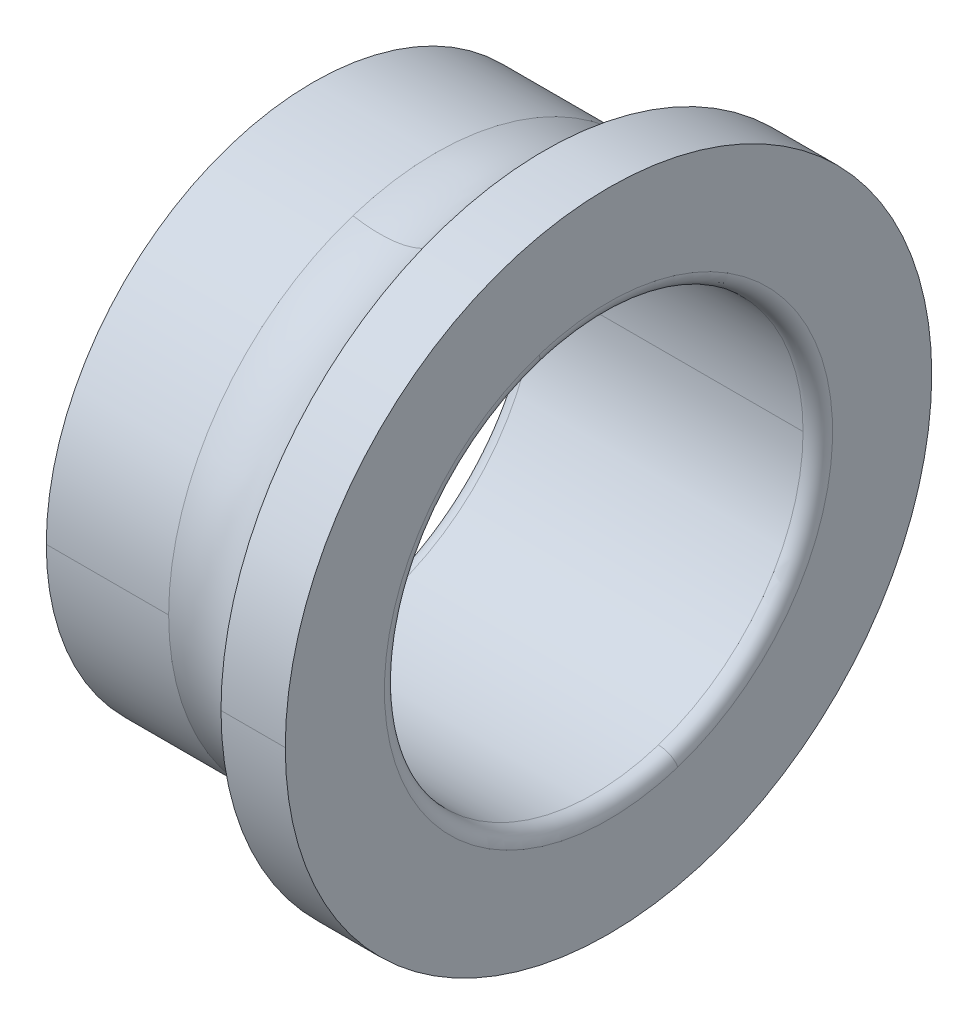
ISO-10303-21;
HEADER;
FILE_DESCRIPTION(('STEP AP214'),'2;1');
FILE_NAME('part.step','',(''),(''),'','','');
FILE_SCHEMA(('AUTOMOTIVE_DESIGN { 1 0 10303 214 1 1 1 1 }'));
ENDSEC;
DATA;
#1=APPLICATION_CONTEXT('core data for automotive mechanical design processes');
#2=APPLICATION_PROTOCOL_DEFINITION('international standard','automotive_design',2000,#1);
#3=PRODUCT_CONTEXT('',#1,'mechanical');
#4=PRODUCT('Part','Part','',(#3));
#5=PRODUCT_RELATED_PRODUCT_CATEGORY('part','',(#4));
#6=PRODUCT_DEFINITION_FORMATION('','',#4);
#7=PRODUCT_DEFINITION_CONTEXT('part definition',#1,'design');
#8=PRODUCT_DEFINITION('design','',#6,#7);
#9=PRODUCT_DEFINITION_SHAPE('','',#8);
#10=(LENGTH_UNIT() NAMED_UNIT(*) SI_UNIT(.MILLI.,.METRE.));
#11=(NAMED_UNIT(*) PLANE_ANGLE_UNIT() SI_UNIT($,.RADIAN.));
#12=(NAMED_UNIT(*) SI_UNIT($,.STERADIAN.) SOLID_ANGLE_UNIT());
#13=UNCERTAINTY_MEASURE_WITH_UNIT(LENGTH_MEASURE(1.E-05),#10,'distance_accuracy_value','');
#14=(GEOMETRIC_REPRESENTATION_CONTEXT(3) GLOBAL_UNCERTAINTY_ASSIGNED_CONTEXT((#13)) GLOBAL_UNIT_ASSIGNED_CONTEXT((#10,
#11,#12)) REPRESENTATION_CONTEXT('',''));
#15=CARTESIAN_POINT('',(0.,0.,0.));
#16=DIRECTION('',(0.,0.,1.));
#17=DIRECTION('',(1.,0.,0.));
#18=AXIS2_PLACEMENT_3D('',#15,#16,#17);
#19=CARTESIAN_POINT('',(12.,0.,0.));
#20=DIRECTION('',(1.,0.,0.));
#21=DIRECTION('',(0.,1.,0.));
#22=AXIS2_PLACEMENT_3D('',#19,#20,#21);
#23=CYLINDRICAL_SURFACE('',#22,10.83);
#24=DIRECTION('',(1.,0.,0.));
#25=VECTOR('',#24,1.);
#26=CARTESIAN_POINT('',(0.,0.,10.83));
#27=LINE('',#26,#25);
#28=CARTESIAN_POINT('',(0.,0.,10.83));
#29=VERTEX_POINT('',#28);
#30=CARTESIAN_POINT('',(4.969085842565,0.,10.83));
#31=VERTEX_POINT('',#30);
#32=EDGE_CURVE('E11',#29,#31,#27,.T.);
#33=ORIENTED_EDGE('',*,*,#32,.F.);
#34=CARTESIAN_POINT('',(0.,0.,0.));
#35=DIRECTION('',(1.,0.,0.));
#36=DIRECTION('',(0.,0.,-1.));
#37=AXIS2_PLACEMENT_3D('',#34,#35,#36);
#38=CIRCLE('',#37,10.83);
#39=CARTESIAN_POINT('',(0.,0.,-10.83));
#40=VERTEX_POINT('',#39);
#41=EDGE_CURVE('E24',#29,#40,#38,.T.);
#42=ORIENTED_EDGE('',*,*,#41,.T.);
#43=DIRECTION('',(1.,0.,0.));
#44=VECTOR('',#43,1.);
#45=CARTESIAN_POINT('',(0.,0.,-10.83));
#46=LINE('',#45,#44);
#47=CARTESIAN_POINT('',(4.969085842565,0.,-10.83));
#48=VERTEX_POINT('',#47);
#49=EDGE_CURVE('E325',#40,#48,#46,.T.);
#50=ORIENTED_EDGE('',*,*,#49,.T.);
#51=CARTESIAN_POINT('',(4.969085842565,0.,0.));
#52=DIRECTION('',(1.,0.,0.));
#53=DIRECTION('',(0.,0.,-1.));
#54=AXIS2_PLACEMENT_3D('',#51,#52,#53);
#55=CIRCLE('',#54,10.83);
#56=CARTESIAN_POINT('',(4.96908584256501,-10.2999420714765,-3.34665404908068));
#57=VERTEX_POINT('',#56);
#58=EDGE_CURVE('E320',#57,#48,#55,.T.);
#59=ORIENTED_EDGE('',*,*,#58,.F.);
#60=CARTESIAN_POINT('',(4.969085842565,0.,0.));
#61=DIRECTION('',(1.,0.,0.));
#62=DIRECTION('',(0.,0.,-1.));
#63=AXIS2_PLACEMENT_3D('',#60,#61,#62);
#64=CIRCLE('',#63,10.83);
#65=EDGE_CURVE('E315',#31,#57,#64,.T.);
#66=ORIENTED_EDGE('',*,*,#65,.F.);
#67=EDGE_LOOP('',(#33,#42,#50,#59,#66));
#68=FACE_BOUND('',#67,.T.);
#69=ADVANCED_FACE('F16',(#68),#23,.T.);
#70=CARTESIAN_POINT('',(5.99999999999977,0.,0.));
#71=DIRECTION('',(1.,0.,0.));
#72=DIRECTION('',(0.,0.309016994374947,-0.951056516295154));
#73=AXIS2_PLACEMENT_3D('',#70,#71,#72);
#74=TOROIDAL_SURFACE('',#73,14.2500000000004,3.57200000000031);
#75=CARTESIAN_POINT('',(5.99999999999977,-13.5525553572063,-4.40349216984313));
#76=DIRECTION('',(0.,0.309016994374947,-0.951056516295154));
#77=DIRECTION('',(-0.288609786515865,0.910586026240071,0.295867335039853));
#78=AXIS2_PLACEMENT_3D('',#75,#76,#77);
#79=CIRCLE('',#78,3.57200000000031);
#80=CARTESIAN_POINT('',(9.3902151849108,-12.4826167763739,-4.05584805117118));
#81=VERTEX_POINT('',#80);
#82=EDGE_CURVE('E311',#57,#81,#79,.T.);
#83=ORIENTED_EDGE('',*,*,#82,.T.);
#84=CARTESIAN_POINT('',(9.3902151849108,0.,0.));
#85=DIRECTION('',(1.,0.,0.));
#86=DIRECTION('',(0.,0.,-1.));
#87=AXIS2_PLACEMENT_3D('',#84,#85,#86);
#88=CIRCLE('',#87,13.125);
#89=CARTESIAN_POINT('',(9.3902151849108,0.,13.125));
#90=VERTEX_POINT('',#89);
#91=EDGE_CURVE('E109',#90,#81,#88,.T.);
#92=ORIENTED_EDGE('',*,*,#91,.F.);
#93=CARTESIAN_POINT('',(9.3902151849108,0.,0.));
#94=DIRECTION('',(1.,0.,0.));
#95=DIRECTION('',(0.,0.,-1.));
#96=AXIS2_PLACEMENT_3D('',#93,#94,#95);
#97=CIRCLE('',#96,13.125);
#98=CARTESIAN_POINT('',(9.3902151849108,12.4826167763739,4.05584805117119));
#99=VERTEX_POINT('',#98);
#100=EDGE_CURVE('E304',#99,#90,#97,.T.);
#101=ORIENTED_EDGE('',*,*,#100,.F.);
#102=CARTESIAN_POINT('',(5.99999999999977,13.5525553572063,4.40349216984313));
#103=DIRECTION('',(0.,-0.309016994374947,0.951056516295154));
#104=DIRECTION('',(-0.288609786515866,-0.91058602624007,-0.295867335039853));
#105=AXIS2_PLACEMENT_3D('',#102,#103,#104);
#106=CIRCLE('',#105,3.57200000000031);
#107=CARTESIAN_POINT('',(4.96908584256501,10.2999420714765,3.34665404908068));
#108=VERTEX_POINT('',#107);
#109=EDGE_CURVE('E119',#108,#99,#106,.T.);
#110=ORIENTED_EDGE('',*,*,#109,.F.);
#111=CARTESIAN_POINT('',(4.969085842565,0.,0.));
#112=DIRECTION('',(1.,0.,0.));
#113=DIRECTION('',(0.,0.,-1.));
#114=AXIS2_PLACEMENT_3D('',#111,#112,#113);
#115=CIRCLE('',#114,10.83);
#116=EDGE_CURVE('E296',#108,#31,#115,.T.);
#117=ORIENTED_EDGE('',*,*,#116,.T.);
#118=ORIENTED_EDGE('',*,*,#65,.T.);
#119=EDGE_LOOP('',(#83,#92,#101,#110,#117,#118));
#120=FACE_BOUND('',#119,.T.);
#121=ADVANCED_FACE('F338',(#120),#74,.F.);
#122=CARTESIAN_POINT('',(12.,0.,0.));
#123=DIRECTION('',(1.,0.,0.));
#124=DIRECTION('',(0.,-1.,0.));
#125=AXIS2_PLACEMENT_3D('',#122,#123,#124);
#126=CYLINDRICAL_SURFACE('',#125,10.83);
#127=ORIENTED_EDGE('',*,*,#32,.T.);
#128=ORIENTED_EDGE('',*,*,#116,.F.);
#129=CARTESIAN_POINT('',(4.969085842565,0.,0.));
#130=DIRECTION('',(1.,0.,0.));
#131=DIRECTION('',(0.,0.,-1.));
#132=AXIS2_PLACEMENT_3D('',#129,#130,#131);
#133=CIRCLE('',#132,10.83);
#134=EDGE_CURVE('E292',#48,#108,#133,.T.);
#135=ORIENTED_EDGE('',*,*,#134,.F.);
#136=ORIENTED_EDGE('',*,*,#49,.F.);
#137=CARTESIAN_POINT('',(0.,0.,0.));
#138=DIRECTION('',(1.,0.,0.));
#139=DIRECTION('',(0.,0.,-1.));
#140=AXIS2_PLACEMENT_3D('',#137,#138,#139);
#141=CIRCLE('',#140,10.83);
#142=EDGE_CURVE('E288',#40,#29,#141,.T.);
#143=ORIENTED_EDGE('',*,*,#142,.T.);
#144=EDGE_LOOP('',(#127,#128,#135,#136,#143));
#145=FACE_BOUND('',#144,.T.);
#146=ADVANCED_FACE('F269',(#145),#126,.T.);
#147=CARTESIAN_POINT('',(0.,10.83,0.));
#148=DIRECTION('',(-1.,0.,0.));
#149=DIRECTION('',(0.,0.,1.));
#150=AXIS2_PLACEMENT_3D('',#147,#148,#149);
#151=PLANE('',#150);
#152=CARTESIAN_POINT('',(0.,0.,0.));
#153=DIRECTION('',(1.,0.,0.));
#154=DIRECTION('',(0.,0.,-1.));
#155=AXIS2_PLACEMENT_3D('',#152,#153,#154);
#156=CIRCLE('',#155,9.1);
#157=CARTESIAN_POINT('',(0.,8.6546142982859,2.81205464881202));
#158=VERTEX_POINT('',#157);
#159=CARTESIAN_POINT('',(0.,-8.6546142982859,-2.81205464881202));
#160=VERTEX_POINT('',#159);
#161=EDGE_CURVE('E286',#158,#160,#156,.T.);
#162=ORIENTED_EDGE('',*,*,#161,.T.);
#163=CARTESIAN_POINT('',(0.,-8.6546142982859,-2.81205464881202));
#164=CARTESIAN_POINT('',(0.,-7.77035322156963,-5.52977285694612));
#165=CARTESIAN_POINT('',(0.,-5.82361355448477,-7.90801404603314));
#166=CARTESIAN_POINT('',(0.,-2.97302640379702,-9.35676213057699));
#167=CARTESIAN_POINT('',(0.,3.15812466204302,-9.71970828071693));
#168=CARTESIAN_POINT('',(0.,7.90499567495906,-5.82227850113272));
#169=CARTESIAN_POINT('',(0.,9.35961636543055,-2.97468359261989));
#170=CARTESIAN_POINT('',(0.,9.53666674238609,0.0936188124392139));
#171=CARTESIAN_POINT('',(0.,8.6546142982859,2.81205464881202));
#172=B_SPLINE_CURVE_WITH_KNOTS('',5,(#163,#164,#165,#166,#167,#168,#169,#170,#171),
.UNSPECIFIED.,.F.,.F.,(6,3,6),(0.,1.5707963267949,3.14159265358979),.UNSPECIFIED.);
#173=EDGE_CURVE('E284',#160,#158,#172,.T.);
#174=ORIENTED_EDGE('',*,*,#173,.T.);
#175=EDGE_LOOP('',(#162,#174));
#176=FACE_BOUND('',#175,.T.);
#177=ORIENTED_EDGE('',*,*,#41,.F.);
#178=ORIENTED_EDGE('',*,*,#142,.F.);
#179=EDGE_LOOP('',(#177,#178));
#180=FACE_BOUND('',#179,.T.);
#181=ADVANCED_FACE('F263',(#176,#180),#151,.T.);
#182=CARTESIAN_POINT('',(0.600000000000048,0.,0.));
#183=DIRECTION('',(1.,0.,0.));
#184=DIRECTION('',(0.,-0.309016994374947,0.951056516295154));
#185=AXIS2_PLACEMENT_3D('',#182,#183,#184);
#186=TOROIDAL_SURFACE('',#185,9.1,0.600000000000048);
#187=CARTESIAN_POINT('',(0.600000000000048,-8.6546142982859,-2.81205464881202));
#188=DIRECTION('',(0.,0.309016994374947,-0.951056516295154));
#189=DIRECTION('',(-1.,0.,0.));
#190=AXIS2_PLACEMENT_3D('',#187,#188,#189);
#191=CIRCLE('',#190,0.600000000000048);
#192=CARTESIAN_POINT('',(0.600000000000001,-8.08398038850876,-2.62664445218704));
#193=VERTEX_POINT('',#192);
#194=EDGE_CURVE('E494',#160,#193,#191,.T.);
#195=ORIENTED_EDGE('',*,*,#194,.T.);
#196=CARTESIAN_POINT('',(0.6,0.,0.));
#197=DIRECTION('',(1.,0.,0.));
#198=DIRECTION('',(0.,0.,-1.));
#199=AXIS2_PLACEMENT_3D('',#196,#197,#198);
#200=CIRCLE('',#199,8.5);
#201=CARTESIAN_POINT('',(0.6,0.,-8.5));
#202=VERTEX_POINT('',#201);
#203=EDGE_CURVE('E492',#193,#202,#200,.T.);
#204=ORIENTED_EDGE('',*,*,#203,.T.);
#205=CARTESIAN_POINT('',(0.6,0.,0.));
#206=DIRECTION('',(1.,0.,0.));
#207=DIRECTION('',(0.,0.,-1.));
#208=AXIS2_PLACEMENT_3D('',#205,#206,#207);
#209=CIRCLE('',#208,8.5);
#210=CARTESIAN_POINT('',(0.6,8.08398038850876,2.62664445218704));
#211=VERTEX_POINT('',#210);
#212=EDGE_CURVE('E490',#202,#211,#209,.T.);
#213=ORIENTED_EDGE('',*,*,#212,.T.);
#214=CARTESIAN_POINT('',(0.600000000000048,8.6546142982859,2.81205464881202));
#215=DIRECTION('',(0.,-0.309016994374947,0.951056516295154));
#216=DIRECTION('',(-1.,0.,0.));
#217=AXIS2_PLACEMENT_3D('',#214,#215,#216);
#218=CIRCLE('',#217,0.600000000000048);
#219=EDGE_CURVE('E243',#158,#211,#218,.T.);
#220=ORIENTED_EDGE('',*,*,#219,.F.);
#221=ORIENTED_EDGE('',*,*,#173,.F.);
#222=EDGE_LOOP('',(#195,#204,#213,#220,#221));
#223=FACE_BOUND('',#222,.T.);
#224=ADVANCED_FACE('F252',(#223),#186,.T.);
#225=CARTESIAN_POINT('',(0.600000000000048,0.,0.));
#226=DIRECTION('',(1.,0.,0.));
#227=DIRECTION('',(0.,0.309016994374947,-0.951056516295154));
#228=AXIS2_PLACEMENT_3D('',#225,#226,#227);
#229=TOROIDAL_SURFACE('',#228,9.1,0.600000000000048);
#230=ORIENTED_EDGE('',*,*,#194,.F.);
#231=ORIENTED_EDGE('',*,*,#161,.F.);
#232=ORIENTED_EDGE('',*,*,#219,.T.);
#233=CARTESIAN_POINT('',(0.6,0.,0.));
#234=DIRECTION('',(1.,0.,0.));
#235=DIRECTION('',(0.,0.,-1.));
#236=AXIS2_PLACEMENT_3D('',#233,#234,#235);
#237=CIRCLE('',#236,8.5);
#238=CARTESIAN_POINT('',(0.6,0.,8.5));
#239=VERTEX_POINT('',#238);
#240=EDGE_CURVE('E239',#211,#239,#237,.T.);
#241=ORIENTED_EDGE('',*,*,#240,.T.);
#242=CARTESIAN_POINT('',(0.6,0.,0.));
#243=DIRECTION('',(1.,0.,0.));
#244=DIRECTION('',(0.,0.,-1.));
#245=AXIS2_PLACEMENT_3D('',#242,#243,#244);
#246=CIRCLE('',#245,8.5);
#247=EDGE_CURVE('E234',#239,#193,#246,.T.);
#248=ORIENTED_EDGE('',*,*,#247,.T.);
#249=EDGE_LOOP('',(#230,#231,#232,#241,#248));
#250=FACE_BOUND('',#249,.T.);
#251=ADVANCED_FACE('F262',(#250),#229,.T.);
#252=CARTESIAN_POINT('',(12.,0.,0.));
#253=DIRECTION('',(1.,0.,0.));
#254=DIRECTION('',(0.,1.,0.));
#255=AXIS2_PLACEMENT_3D('',#252,#253,#254);
#256=CYLINDRICAL_SURFACE('',#255,8.5);
#257=DIRECTION('',(1.,0.,0.));
#258=VECTOR('',#257,1.);
#259=CARTESIAN_POINT('',(0.6,0.,8.5));
#260=LINE('',#259,#258);
#261=CARTESIAN_POINT('',(11.4,0.,8.5));
#262=VERTEX_POINT('',#261);
#263=EDGE_CURVE('E230',#239,#262,#260,.T.);
#264=ORIENTED_EDGE('',*,*,#263,.T.);
#265=CARTESIAN_POINT('',(11.4,0.,0.));
#266=DIRECTION('',(1.,0.,0.));
#267=DIRECTION('',(0.,0.,-1.));
#268=AXIS2_PLACEMENT_3D('',#265,#266,#267);
#269=CIRCLE('',#268,8.5);
#270=CARTESIAN_POINT('',(11.4,-8.08398038850888,-2.62664445218707));
#271=VERTEX_POINT('',#270);
#272=EDGE_CURVE('E226',#262,#271,#269,.T.);
#273=ORIENTED_EDGE('',*,*,#272,.T.);
#274=CARTESIAN_POINT('',(11.4,0.,0.));
#275=DIRECTION('',(1.,0.,0.));
#276=DIRECTION('',(0.,0.,-1.));
#277=AXIS2_PLACEMENT_3D('',#274,#275,#276);
#278=CIRCLE('',#277,8.5);
#279=CARTESIAN_POINT('',(11.4,0.,-8.5));
#280=VERTEX_POINT('',#279);
#281=EDGE_CURVE('E222',#271,#280,#278,.T.);
#282=ORIENTED_EDGE('',*,*,#281,.T.);
#283=DIRECTION('',(1.,0.,0.));
#284=VECTOR('',#283,1.);
#285=CARTESIAN_POINT('',(0.6,0.,-8.5));
#286=LINE('',#285,#284);
#287=EDGE_CURVE('E217',#202,#280,#286,.T.);
#288=ORIENTED_EDGE('',*,*,#287,.F.);
#289=ORIENTED_EDGE('',*,*,#203,.F.);
#290=ORIENTED_EDGE('',*,*,#247,.F.);
#291=EDGE_LOOP('',(#264,#273,#282,#288,#289,#290));
#292=FACE_BOUND('',#291,.T.);
#293=ADVANCED_FACE('F390',(#292),#256,.F.);
#294=CARTESIAN_POINT('',(12.,0.,0.));
#295=DIRECTION('',(1.,0.,0.));
#296=DIRECTION('',(0.,-1.,0.));
#297=AXIS2_PLACEMENT_3D('',#294,#295,#296);
#298=CYLINDRICAL_SURFACE('',#297,8.5);
#299=ORIENTED_EDGE('',*,*,#263,.F.);
#300=ORIENTED_EDGE('',*,*,#240,.F.);
#301=ORIENTED_EDGE('',*,*,#212,.F.);
#302=ORIENTED_EDGE('',*,*,#287,.T.);
#303=CARTESIAN_POINT('',(11.4,0.,0.));
#304=DIRECTION('',(1.,0.,0.));
#305=DIRECTION('',(0.,0.,-1.));
#306=AXIS2_PLACEMENT_3D('',#303,#304,#305);
#307=CIRCLE('',#306,8.5);
#308=CARTESIAN_POINT('',(11.4,8.08398038850888,2.62664445218708));
#309=VERTEX_POINT('',#308);
#310=EDGE_CURVE('E213',#280,#309,#307,.T.);
#311=ORIENTED_EDGE('',*,*,#310,.T.);
#312=CARTESIAN_POINT('',(11.4,0.,0.));
#313=DIRECTION('',(1.,0.,0.));
#314=DIRECTION('',(0.,0.,-1.));
#315=AXIS2_PLACEMENT_3D('',#312,#313,#314);
#316=CIRCLE('',#315,8.5);
#317=EDGE_CURVE('E208',#309,#262,#316,.T.);
#318=ORIENTED_EDGE('',*,*,#317,.T.);
#319=EDGE_LOOP('',(#299,#300,#301,#302,#311,#318));
#320=FACE_BOUND('',#319,.T.);
#321=ADVANCED_FACE('F400',(#320),#298,.F.);
#322=CARTESIAN_POINT('',(11.4,0.,0.));
#323=DIRECTION('',(1.,0.,0.));
#324=DIRECTION('',(0.,0.309016994374947,-0.951056516295154));
#325=AXIS2_PLACEMENT_3D('',#322,#323,#324);
#326=TOROIDAL_SURFACE('',#325,9.1,0.599999999999927);
#327=CARTESIAN_POINT('',(11.4,-8.6546142982859,-2.81205464881202));
#328=DIRECTION('',(0.,0.309016994374947,-0.951056516295154));
#329=DIRECTION('',(0.,0.951056516295154,0.309016994374947));
#330=AXIS2_PLACEMENT_3D('',#327,#328,#329);
#331=CIRCLE('',#330,0.599999999999927);
#332=CARTESIAN_POINT('',(11.9999999999999,-8.6546142982859,-2.81205464881202));
#333=VERTEX_POINT('',#332);
#334=EDGE_CURVE('E187',#271,#333,#331,.T.);
#335=ORIENTED_EDGE('',*,*,#334,.F.);
#336=ORIENTED_EDGE('',*,*,#272,.F.);
#337=ORIENTED_EDGE('',*,*,#317,.F.);
#338=CARTESIAN_POINT('',(11.4,8.6546142982859,2.81205464881202));
#339=DIRECTION('',(0.,-0.309016994374947,0.951056516295154));
#340=DIRECTION('',(0.,-0.951056516295154,-0.309016994374947));
#341=AXIS2_PLACEMENT_3D('',#338,#339,#340);
#342=CIRCLE('',#341,0.599999999999927);
#343=CARTESIAN_POINT('',(11.9999999999999,8.6546142982859,2.81205464881202));
#344=VERTEX_POINT('',#343);
#345=EDGE_CURVE('E186',#309,#344,#342,.T.);
#346=ORIENTED_EDGE('',*,*,#345,.T.);
#347=CARTESIAN_POINT('',(11.9999999999999,8.65461429828589,2.81205464881204));
#348=CARTESIAN_POINT('',(11.9999999999999,8.60860511914574,2.95366656315673));
#349=CARTESIAN_POINT('',(11.9999999999999,8.55911447032686,3.09414699684201));
#350=CARTESIAN_POINT('',(11.9999999999999,8.45330243894805,3.37251140646159));
#351=CARTESIAN_POINT('',(11.9999999999999,8.39698105638814,3.51039538239588));
#352=CARTESIAN_POINT('',(11.9999999999999,8.27763976314372,3.78323338008131));
#353=CARTESIAN_POINT('',(11.9999999999999,8.21461985245923,3.91818740183245));
#354=CARTESIAN_POINT('',(11.9999999999999,8.08203425525104,4.1848407292831));
#355=CARTESIAN_POINT('',(11.9999999999999,8.01246856872733,4.3165400349826));
#356=CARTESIAN_POINT('',(11.9999999999999,7.86695875999756,4.576366560262));
#357=CARTESIAN_POINT('',(11.9999999999999,7.79101463779149,4.70449377984189));
#358=CARTESIAN_POINT('',(11.9999999999999,7.63293098063957,4.9568674886172));
#359=CARTESIAN_POINT('',(11.9999999999999,7.55079144569371,5.08111397781262));
#360=CARTESIAN_POINT('',(11.9999999999999,7.38051482647062,5.32542689832994));
#361=CARTESIAN_POINT('',(11.9999999999999,7.29237774219337,5.44549332965184));
#362=CARTESIAN_POINT('',(11.9999999999999,7.11031835906663,5.68115688569824));
#363=CARTESIAN_POINT('',(11.9999999999999,7.01639606021713,5.79675401042276));
#364=CARTESIAN_POINT('',(11.9999999999999,6.82299251370341,6.02320046918661));
#365=CARTESIAN_POINT('',(11.9999999999999,6.7235112660392,6.13404980322595));
#366=CARTESIAN_POINT('',(11.9999999999999,6.51922948128005,6.35073363499558));
#367=CARTESIAN_POINT('',(11.9999999999999,6.41442894418512,6.45656813272588));
#368=CARTESIAN_POINT('',(11.9999999999999,6.19976105414544,6.66296732726726));
#369=CARTESIAN_POINT('',(11.9999999999999,6.08989370120069,6.76353202407835));
#370=CARTESIAN_POINT('',(11.9999999999999,5.86535685956264,6.95914934762769));
#371=CARTESIAN_POINT('',(11.9999999999999,5.75068737086933,7.05420197436594));
#372=CARTESIAN_POINT('',(11.9999999999999,5.51682250656963,7.23856616766363));
#373=CARTESIAN_POINT('',(11.9999999999999,5.39762713096324,7.32787773422308));
#374=CARTESIAN_POINT('',(11.9999999999999,5.15499764493929,7.50054464777724));
#375=CARTESIAN_POINT('',(11.9999999999999,5.03156353452172,7.58389999477195));
#376=CARTESIAN_POINT('',(11.9999999999999,4.78075394245847,7.74445365886448));
#377=CARTESIAN_POINT('',(11.9999999999999,4.65337846081279,7.82165197596229));
#378=CARTESIAN_POINT('',(11.9999999999999,4.3949929849855,7.96970560275342));
#379=CARTESIAN_POINT('',(11.9999999999999,4.2639829908039,8.04056091244673));
#380=CARTESIAN_POINT('',(11.9999999999999,3.99864410445583,8.17575782778158));
#381=CARTESIAN_POINT('',(11.9999999999999,3.86431521228938,8.24009943342312));
#382=CARTESIAN_POINT('',(11.9999999999999,3.59266214003866,8.3621139360908));
#383=CARTESIAN_POINT('',(11.9999999999999,3.45533795995441,8.41978683311693));
#384=CARTESIAN_POINT('',(11.9999999999999,3.1780251378461,8.5283249794933));
#385=CARTESIAN_POINT('',(11.9999999999999,3.03803649582205,8.57919022884354));
#386=CARTESIAN_POINT('',(11.9999999999999,2.75573199473434,8.67399054102716));
#387=CARTESIAN_POINT('',(11.9999999999999,2.61341613567068,8.71792560386054));
#388=CARTESIAN_POINT('',(11.9999999999999,2.32680005187365,8.79875969959584));
#389=CARTESIAN_POINT('',(11.9999999999999,2.18249982714027,8.83565873249775));
#390=CARTESIAN_POINT('',(11.9999999999999,1.89226264388438,8.90233187536787));
#391=CARTESIAN_POINT('',(11.9999999999999,1.74632568536187,8.93210598533607));
#392=CARTESIAN_POINT('',(11.9999999999999,1.45316660944336,8.98445755389996));
#393=CARTESIAN_POINT('',(11.9999999999999,1.30594449204736,9.00703501249564));
#394=CARTESIAN_POINT('',(11.9999999999999,1.01056976935783,9.04493888723916));
#395=CARTESIAN_POINT('',(11.9999999999999,0.862417164064294,9.060265303387));
#396=CARTESIAN_POINT('',(11.9999999999999,0.565538378182463,9.08363017055592));
#397=CARTESIAN_POINT('',(11.9999999999999,0.41681219759417,9.091668621577));
#398=CARTESIAN_POINT('',(11.9999999999999,0.119144555518741,9.10043819315979));
#399=CARTESIAN_POINT('',(11.9999999999999,-0.0297969059683946,9.1011693137215));
#400=CARTESIAN_POINT('',(11.9999999999999,-0.327536296815056,9.09532246305208));
#401=CARTESIAN_POINT('',(11.9999999999999,-0.476334226174581,9.08874449182095));
#402=CARTESIAN_POINT('',(11.9999999999999,-0.773428085521034,9.06829530447473));
#403=CARTESIAN_POINT('',(11.9999999999999,-0.921724015507962,9.05442408835962));
#404=CARTESIAN_POINT('',(11.9999999999999,-1.21745661822469,9.01942182822004));
#405=CARTESIAN_POINT('',(11.9999999999999,-1.3648932909545,8.99829078419555));
#406=CARTESIAN_POINT('',(11.9999999999999,-1.65855219129844,8.94881977477311));
#407=CARTESIAN_POINT('',(11.9999999999999,-1.80477441891259,8.92047980937516));
#408=CARTESIAN_POINT('',(11.9999999999999,-2.09565216687134,8.85665923066472));
#409=CARTESIAN_POINT('',(11.9999999999999,-2.24030768721596,8.82117861735223));
#410=CARTESIAN_POINT('',(11.9999999999999,-2.5277035328168,8.74316221871793));
#411=CARTESIAN_POINT('',(11.9999999999999,-2.67044385807303,8.70062643339611));
#412=CARTESIAN_POINT('',(11.9999999999999,-2.95366543955102,8.60860216317568));
#413=CARTESIAN_POINT('',(11.9999999999999,-3.09414669577276,8.55911367827707));
#414=CARTESIAN_POINT('',(11.9999999999999,-3.37251170753082,8.45330323099785));
#415=CARTESIAN_POINT('',(11.9999999999999,-3.51039546306713,8.39698126861724));
#416=CARTESIAN_POINT('',(11.9999999999999,-3.78323329941004,8.27763955091463));
#417=CARTESIAN_POINT('',(11.9999999999999,-3.91818738021664,8.21461979559262));
#418=CARTESIAN_POINT('',(11.9999999999999,-4.18484075089888,8.08203431211766));
#419=CARTESIAN_POINT('',(11.9999999999999,-4.31654004077453,8.01246858396471));
#420=CARTESIAN_POINT('',(11.9999999999999,-4.57636655447005,7.8669587447602));
#421=CARTESIAN_POINT('',(11.9999999999999,-4.70449377828993,7.79101463370866));
#422=CARTESIAN_POINT('',(11.9999999999999,-4.95686749016913,7.63293098472241));
#423=CARTESIAN_POINT('',(11.9999999999999,-5.08111397822846,7.55079144678772));
#424=CARTESIAN_POINT('',(11.9999999999999,-5.32542689791409,7.38051482537663));
#425=CARTESIAN_POINT('',(11.9999999999999,-5.4454933295404,7.29237774190024));
#426=CARTESIAN_POINT('',(11.9999999999999,-5.68115688580966,7.11031835935977));
#427=CARTESIAN_POINT('',(11.9999999999999,-5.7967540104526,7.01639606029568));
#428=CARTESIAN_POINT('',(11.9999999999999,-6.02320046915674,6.82299251362488));
#429=CARTESIAN_POINT('',(11.9999999999999,-6.13404980321794,6.72351126601816));
#430=CARTESIAN_POINT('',(11.9999999999999,-6.35073363500357,6.5192294813011));
#431=CARTESIAN_POINT('',(11.9999999999999,-6.45656813272801,6.41442894419076));
#432=CARTESIAN_POINT('',(11.9999999999999,-6.66296732726511,6.19976105413981));
#433=CARTESIAN_POINT('',(11.9999999999999,-6.76353202407777,6.08989370119919));
#434=CARTESIAN_POINT('',(11.9999999999999,-6.95914934762826,5.86535685956416));
#435=CARTESIAN_POINT('',(11.9999999999999,-7.05420197436608,5.75068737086975));
#436=CARTESIAN_POINT('',(11.9999999999999,-7.23856616766347,5.51682250656924));
#437=CARTESIAN_POINT('',(11.9999999999999,-7.32787773422303,5.39762713096315));
#438=CARTESIAN_POINT('',(11.9999999999999,-7.50054464777727,5.15499764493941));
#439=CARTESIAN_POINT('',(11.9999999999999,-7.58389999477195,5.03156353452176));
#440=CARTESIAN_POINT('',(11.9999999999999,-7.74445365886446,4.78075394245845));
#441=CARTESIAN_POINT('',(11.9999999999999,-7.82165197596228,4.65337846081279));
#442=CARTESIAN_POINT('',(11.9999999999999,-7.96970560275342,4.39499298498552));
#443=CARTESIAN_POINT('',(11.9999999999999,-8.04056091244673,4.26398299080391));
#444=CARTESIAN_POINT('',(11.9999999999999,-8.17575782778157,3.99864410445584));
#445=CARTESIAN_POINT('',(11.9999999999999,-8.24009943342311,3.86431521228939));
#446=CARTESIAN_POINT('',(11.9999999999999,-8.3621139360908,3.59266214003867));
#447=CARTESIAN_POINT('',(11.9999999999999,-8.41978683311696,3.45533795995441));
#448=CARTESIAN_POINT('',(11.9999999999999,-8.52832497949327,3.17802513784612));
#449=CARTESIAN_POINT('',(11.9999999999999,-8.57919022884342,3.03803649582209));
#450=CARTESIAN_POINT('',(11.9999999999999,-8.67399054102727,2.75573199473432));
#451=CARTESIAN_POINT('',(11.9999999999999,-8.71792560386096,2.61341613567058));
#452=CARTESIAN_POINT('',(11.9999999999999,-8.79875969959542,2.32680005187377));
#453=CARTESIAN_POINT('',(11.9999999999999,-8.83565873249619,2.1824998271407));
#454=CARTESIAN_POINT('',(11.9999999999999,-8.90233187536943,1.89226264388397));
#455=CARTESIAN_POINT('',(11.9999999999999,-8.9321059853419,1.7463256853603));
#456=CARTESIAN_POINT('',(11.9999999999999,-8.98445755389413,1.45316660944496));
#457=CARTESIAN_POINT('',(11.9999999999999,-9.00703501247391,1.30594449205328));
#458=CARTESIAN_POINT('',(11.9999999999999,-9.04493888726089,1.01056976935195));
#459=CARTESIAN_POINT('',(11.9999999999999,-9.0602653034681,0.862417164042297));
#460=CARTESIAN_POINT('',(11.9999999999999,-9.08363017047483,0.565538378204493));
#461=CARTESIAN_POINT('',(11.9999999999999,-9.09166862127435,0.416812197676342));
#462=CARTESIAN_POINT('',(11.9999999999999,-9.10043819346243,0.119144555436602));
#463=CARTESIAN_POINT('',(11.9999999999999,-9.10116931485098,-0.0297969062749878));
#464=CARTESIAN_POINT('',(11.9999999999999,-9.0953224619226,-0.327536296508429));
#465=CARTESIAN_POINT('',(11.9999999999999,-9.08874448760566,-0.476334225030281));
#466=CARTESIAN_POINT('',(11.9999999999999,-9.06829530869003,-0.773428086665303));
#467=CARTESIAN_POINT('',(11.9999999999999,-9.05442410409133,-0.921724019778474));
#468=CARTESIAN_POINT('',(11.9999999999999,-9.01942181248834,-1.21745661395416));
#469=CARTESIAN_POINT('',(11.9999999999999,-8.99829072548404,-1.36489327501668));
#470=CARTESIAN_POINT('',(11.9999999999999,-8.94881983348462,-1.65855220723624));
#471=CARTESIAN_POINT('',(11.9999999999999,-8.92048002848949,-1.80477447839329));
#472=CARTESIAN_POINT('',(11.9999999999999,-8.85665901155039,-2.09565210739062));
#473=CARTESIAN_POINT('',(11.9999999999999,-8.82117779960643,-2.24030746523089));
#474=CARTESIAN_POINT('',(11.9999999999999,-8.74316303646373,-2.52770375480184));
#475=CARTESIAN_POINT('',(11.9999999999999,-8.700629485265,-2.67044468653252));
#476=CARTESIAN_POINT('',(11.9999999999999,-8.6546142982859,-2.81205464881201));
#477=B_SPLINE_CURVE_WITH_KNOTS('',3,(#347,#348,#349,#350,#351,#352,#353,#354,#355,#356,#357,
#358,#359,#360,#361,#362,#363,#364,#365,#366,#367,#368,#369,#370,#371,#372,#373,#374,#375,#376,
#377,#378,#379,#380,#381,#382,#383,#384,#385,#386,#387,#388,#389,#390,#391,#392,#393,#394,#395,
#396,#397,#398,#399,#400,#401,#402,#403,#404,#405,#406,#407,#408,#409,#410,#411,#412,#413,#414,
#415,#416,#417,#418,#419,#420,#421,#422,#423,#424,#425,#426,#427,#428,#429,#430,#431,#432,#433,
#434,#435,#436,#437,#438,#439,#440,#441,#442,#443,#444,#445,#446,#447,#448,#449,#450,#451,#452,
#453,#454,#455,#456,#457,#458,#459,#460,#461,#462,#463,#464,#465,#466,#467,#468,#469,#470,#471,
#472,#473,#474,#475,#476),.UNSPECIFIED.,.F.,.F.,(4,2,2,2,2,2,2,2,2,2,2,2,2,2,2,2,2,2,2,2,2,2,2,
2,2,2,2,2,2,2,2,2,2,2,2,2,2,2,2,2,2,2,2,2,2,2,2,2,2,2,2,2,2,2,2,2,2,2,2,2,2,2,2,2,4),(0.,
0.446650359117002,0.893300718234006,1.33995107735101,1.78660143646801,2.23325179558501,
2.67990215470202,3.12655251381902,3.57320287293603,4.01985323205303,4.46650359117003,
4.91315395028704,5.35980430940404,5.80645466852104,6.25310502763804,6.69975538675505,
7.14640574587205,7.59305610498905,8.03970646410606,8.48635682322306,8.93300718234006,
9.37965754145707,9.82630790057408,10.2729582596911,10.7196086188081,11.1662589779251,
11.6129093370421,12.0595596961591,12.5062100552761,12.9528604143931,13.3995107735101,
13.8461611326271,14.2928114917441,14.7394618508611,15.1861122099781,15.6327625690951,
16.0794129282121,16.5260632873291,16.9727136464461,17.4193640055631,17.8660143646801,
18.3126647237971,18.7593150829141,19.2059654420311,19.6526158011481,20.0992661602651,
20.5459165193821,20.9925668784992,21.4392172376162,21.8858675967332,22.3325179558502,
22.7791683149672,23.2258186740842,23.6724690332012,24.1191193923182,24.5657697514352,
25.0124201105522,25.4590704696692,25.9057208287862,26.3523711879032,26.7990215470202,
27.2456719061372,27.6923222652542,28.1389726243712,28.5856229834882),.UNSPECIFIED.);
#478=EDGE_CURVE('E181',#344,#333,#477,.T.);
#479=ORIENTED_EDGE('',*,*,#478,.T.);
#480=EDGE_LOOP('',(#335,#336,#337,#346,#479));
#481=FACE_BOUND('',#480,.T.);
#482=ADVANCED_FACE('F161',(#481),#326,.T.);
#483=CARTESIAN_POINT('',(12.,9.1,0.));
#484=DIRECTION('',(1.,0.,0.));
#485=DIRECTION('',(0.,0.,-1.));
#486=AXIS2_PLACEMENT_3D('',#483,#484,#485);
#487=PLANE('',#486);
#488=CARTESIAN_POINT('',(12.,0.,0.));
#489=DIRECTION('',(1.,0.,0.));
#490=DIRECTION('',(0.,0.,-1.));
#491=AXIS2_PLACEMENT_3D('',#488,#489,#490);
#492=CIRCLE('',#491,13.125);
#493=CARTESIAN_POINT('',(12.,0.,-13.125));
#494=VERTEX_POINT('',#493);
#495=CARTESIAN_POINT('',(12.,0.,13.125));
#496=VERTEX_POINT('',#495);
#497=EDGE_CURVE('E126',#494,#496,#492,.T.);
#498=ORIENTED_EDGE('',*,*,#497,.T.);
#499=CARTESIAN_POINT('',(12.,0.,0.));
#500=DIRECTION('',(1.,0.,0.));
#501=DIRECTION('',(0.,0.,-1.));
#502=AXIS2_PLACEMENT_3D('',#499,#500,#501);
#503=CIRCLE('',#502,13.125);
#504=EDGE_CURVE('E189',#496,#494,#503,.T.);
#505=ORIENTED_EDGE('',*,*,#504,.T.);
#506=EDGE_LOOP('',(#498,#505));
#507=FACE_BOUND('',#506,.T.);
#508=CARTESIAN_POINT('',(11.9999999999999,-8.65461429828589,-2.81205464881204));
#509=CARTESIAN_POINT('',(11.9999999999999,-8.60860511914574,-2.95366656315673));
#510=CARTESIAN_POINT('',(11.9999999999999,-8.55911447032686,-3.09414699684201));
#511=CARTESIAN_POINT('',(11.9999999999999,-8.45330243894805,-3.37251140646159));
#512=CARTESIAN_POINT('',(11.9999999999999,-8.39698105638814,-3.51039538239588));
#513=CARTESIAN_POINT('',(11.9999999999999,-8.27763976314372,-3.78323338008131));
#514=CARTESIAN_POINT('',(11.9999999999999,-8.21461985245923,-3.91818740183245));
#515=CARTESIAN_POINT('',(11.9999999999999,-8.08203425525104,-4.18484072928309));
#516=CARTESIAN_POINT('',(11.9999999999999,-8.01246856872733,-4.3165400349826));
#517=CARTESIAN_POINT('',(11.9999999999999,-7.86695875999756,-4.576366560262));
#518=CARTESIAN_POINT('',(11.9999999999999,-7.79101463779149,-4.70449377984189));
#519=CARTESIAN_POINT('',(11.9999999999999,-7.63293098063957,-4.9568674886172));
#520=CARTESIAN_POINT('',(11.9999999999999,-7.55079144569372,-5.08111397781262));
#521=CARTESIAN_POINT('',(11.9999999999999,-7.38051482647062,-5.32542689832994));
#522=CARTESIAN_POINT('',(11.9999999999999,-7.29237774219337,-5.44549332965183));
#523=CARTESIAN_POINT('',(11.9999999999999,-7.11031835906663,-5.68115688569824));
#524=CARTESIAN_POINT('',(11.9999999999999,-7.01639606021713,-5.79675401042275));
#525=CARTESIAN_POINT('',(11.9999999999999,-6.82299251370342,-6.0232004691866));
#526=CARTESIAN_POINT('',(11.9999999999999,-6.7235112660392,-6.13404980322594));
#527=CARTESIAN_POINT('',(11.9999999999999,-6.51922948128005,-6.35073363499558));
#528=CARTESIAN_POINT('',(11.9999999999999,-6.41442894418512,-6.45656813272587));
#529=CARTESIAN_POINT('',(11.9999999999999,-6.19976105414544,-6.66296732726726));
#530=CARTESIAN_POINT('',(11.9999999999999,-6.0898937012007,-6.76353202407835));
#531=CARTESIAN_POINT('',(11.9999999999999,-5.86535685956264,-6.95914934762768));
#532=CARTESIAN_POINT('',(11.9999999999999,-5.75068737086933,-7.05420197436593));
#533=CARTESIAN_POINT('',(11.9999999999999,-5.51682250656963,-7.23856616766363));
#534=CARTESIAN_POINT('',(11.9999999999999,-5.39762713096325,-7.32787773422308));
#535=CARTESIAN_POINT('',(11.9999999999999,-5.15499764493929,-7.50054464777724));
#536=CARTESIAN_POINT('',(11.9999999999999,-5.03156353452172,-7.58389999477195));
#537=CARTESIAN_POINT('',(11.9999999999999,-4.78075394245847,-7.74445365886447));
#538=CARTESIAN_POINT('',(11.9999999999999,-4.65337846081279,-7.82165197596229));
#539=CARTESIAN_POINT('',(11.9999999999999,-4.39499298498551,-7.96970560275341));
#540=CARTESIAN_POINT('',(11.9999999999999,-4.2639829908039,-8.04056091244672));
#541=CARTESIAN_POINT('',(11.9999999999999,-3.99864410445584,-8.17575782778157));
#542=CARTESIAN_POINT('',(11.9999999999999,-3.86431521228938,-8.24009943342312));
#543=CARTESIAN_POINT('',(11.9999999999999,-3.59266214003867,-8.3621139360908));
#544=CARTESIAN_POINT('',(11.9999999999999,-3.45533795995441,-8.41978683311693));
#545=CARTESIAN_POINT('',(11.9999999999999,-3.17802513784611,-8.52832497949329));
#546=CARTESIAN_POINT('',(11.9999999999999,-3.03803649582205,-8.57919022884353));
#547=CARTESIAN_POINT('',(11.9999999999999,-2.75573199473435,-8.67399054102716));
#548=CARTESIAN_POINT('',(11.9999999999999,-2.61341613567069,-8.71792560386054));
#549=CARTESIAN_POINT('',(11.9999999999999,-2.32680005187366,-8.79875969959584));
#550=CARTESIAN_POINT('',(11.9999999999999,-2.18249982714028,-8.83565873249775));
#551=CARTESIAN_POINT('',(11.9999999999999,-1.89226264388439,-8.90233187536787));
#552=CARTESIAN_POINT('',(11.9999999999999,-1.74632568536188,-8.93210598533607));
#553=CARTESIAN_POINT('',(11.9999999999999,-1.45316660944338,-8.98445755389995));
#554=CARTESIAN_POINT('',(11.9999999999999,-1.30594449204738,-9.00703501249563));
#555=CARTESIAN_POINT('',(11.9999999999999,-1.01056976935785,-9.04493888723916));
#556=CARTESIAN_POINT('',(11.9999999999999,-0.862417164064308,-9.060265303387));
#557=CARTESIAN_POINT('',(11.9999999999999,-0.565538378182475,-9.08363017055592));
#558=CARTESIAN_POINT('',(11.9999999999999,-0.41681219759418,-9.091668621577));
#559=CARTESIAN_POINT('',(11.9999999999999,-0.119144555518751,-9.10043819315979));
#560=CARTESIAN_POINT('',(11.9999999999999,0.0297969059683832,-9.1011693137215));
#561=CARTESIAN_POINT('',(11.9999999999999,0.327536296815044,-9.09532246305208));
#562=CARTESIAN_POINT('',(11.9999999999999,0.476334226174571,-9.08874449182095));
#563=CARTESIAN_POINT('',(11.9999999999999,0.773428085521023,-9.06829530447473));
#564=CARTESIAN_POINT('',(11.9999999999999,0.92172401550795,-9.05442408835962));
#565=CARTESIAN_POINT('',(11.9999999999999,1.21745661822468,-9.01942182822004));
#566=CARTESIAN_POINT('',(11.9999999999999,1.36489329095448,-8.99829078419555));
#567=CARTESIAN_POINT('',(11.9999999999999,1.65855219129843,-8.94881977477311));
#568=CARTESIAN_POINT('',(11.9999999999999,1.80477441891258,-8.92047980937516));
#569=CARTESIAN_POINT('',(11.9999999999999,2.09565216687133,-8.85665923066472));
#570=CARTESIAN_POINT('',(11.9999999999999,2.24030768721594,-8.82117861735224));
#571=CARTESIAN_POINT('',(11.9999999999999,2.52770353281678,-8.74316221871793));
#572=CARTESIAN_POINT('',(11.9999999999999,2.67044385807302,-8.70062643339612));
#573=CARTESIAN_POINT('',(11.9999999999999,2.953665439551,-8.60860216317569));
#574=CARTESIAN_POINT('',(11.9999999999999,3.09414669577275,-8.55911367827708));
#575=CARTESIAN_POINT('',(11.9999999999999,3.37251170753081,-8.45330323099786));
#576=CARTESIAN_POINT('',(11.9999999999999,3.51039546306712,-8.39698126861725));
#577=CARTESIAN_POINT('',(11.9999999999999,3.78323329941003,-8.27763955091463));
#578=CARTESIAN_POINT('',(11.9999999999999,3.91818738021663,-8.21461979559263));
#579=CARTESIAN_POINT('',(11.9999999999999,4.18484075089887,-8.08203431211767));
#580=CARTESIAN_POINT('',(11.9999999999999,4.31654004077452,-8.01246858396471));
#581=CARTESIAN_POINT('',(11.9999999999999,4.57636655447004,-7.86695874476021));
#582=CARTESIAN_POINT('',(11.9999999999999,4.70449377828992,-7.79101463370866));
#583=CARTESIAN_POINT('',(11.9999999999999,4.95686749016913,-7.63293098472242));
#584=CARTESIAN_POINT('',(11.9999999999999,5.08111397822845,-7.55079144678772));
#585=CARTESIAN_POINT('',(11.9999999999999,5.32542689791408,-7.38051482537664));
#586=CARTESIAN_POINT('',(11.9999999999999,5.44549332954039,-7.29237774190025));
#587=CARTESIAN_POINT('',(11.9999999999999,5.68115688580965,-7.11031835935978));
#588=CARTESIAN_POINT('',(11.9999999999999,5.79675401045259,-7.01639606029569));
#589=CARTESIAN_POINT('',(11.9999999999999,6.02320046915673,-6.82299251362489));
#590=CARTESIAN_POINT('',(11.9999999999999,6.13404980321792,-6.72351126601817));
#591=CARTESIAN_POINT('',(11.9999999999999,6.35073363500356,-6.51922948130111));
#592=CARTESIAN_POINT('',(11.9999999999999,6.456568132728,-6.41442894419078));
#593=CARTESIAN_POINT('',(11.9999999999999,6.6629673272651,-6.19976105413982));
#594=CARTESIAN_POINT('',(11.9999999999999,6.76353202407776,-6.08989370119921));
#595=CARTESIAN_POINT('',(11.9999999999999,6.95914934762824,-5.86535685956418));
#596=CARTESIAN_POINT('',(11.9999999999999,7.05420197436607,-5.75068737086976));
#597=CARTESIAN_POINT('',(11.9999999999999,7.23856616766346,-5.51682250656925));
#598=CARTESIAN_POINT('',(11.9999999999999,7.32787773422302,-5.39762713096316));
#599=CARTESIAN_POINT('',(11.9999999999999,7.50054464777726,-5.15499764493942));
#600=CARTESIAN_POINT('',(11.9999999999999,7.58389999477194,-5.03156353452178));
#601=CARTESIAN_POINT('',(11.9999999999999,7.74445365886445,-4.78075394245847));
#602=CARTESIAN_POINT('',(11.9999999999999,7.82165197596227,-4.65337846081281));
#603=CARTESIAN_POINT('',(11.9999999999999,7.9697056027534,-4.39499298498554));
#604=CARTESIAN_POINT('',(11.9999999999999,8.04056091244671,-4.26398299080393));
#605=CARTESIAN_POINT('',(11.9999999999999,8.17575782778156,-3.99864410445586));
#606=CARTESIAN_POINT('',(11.9999999999999,8.2400994334231,-3.86431521228941));
#607=CARTESIAN_POINT('',(11.9999999999999,8.3621139360908,-3.59266214003869));
#608=CARTESIAN_POINT('',(11.9999999999999,8.41978683311695,-3.45533795995443));
#609=CARTESIAN_POINT('',(11.9999999999999,8.52832497949326,-3.17802513784614));
#610=CARTESIAN_POINT('',(11.9999999999999,8.57919022884342,-3.03803649582211));
#611=CARTESIAN_POINT('',(11.9999999999999,8.67399054102726,-2.75573199473434));
#612=CARTESIAN_POINT('',(11.9999999999999,8.71792560386095,-2.6134161356706));
#613=CARTESIAN_POINT('',(11.9999999999999,8.79875969959541,-2.3268000518738));
#614=CARTESIAN_POINT('',(11.9999999999999,8.83565873249619,-2.18249982714073));
#615=CARTESIAN_POINT('',(11.9999999999999,8.90233187536942,-1.89226264388399));
#616=CARTESIAN_POINT('',(11.9999999999999,8.93210598534189,-1.74632568536033));
#617=CARTESIAN_POINT('',(11.9999999999999,8.98445755389413,-1.45316660944498));
#618=CARTESIAN_POINT('',(11.9999999999999,9.0070350124739,-1.3059444920533));
#619=CARTESIAN_POINT('',(11.9999999999999,9.04493888726089,-1.01056976935197));
#620=CARTESIAN_POINT('',(11.9999999999999,9.0602653034681,-0.862417164042322));
#621=CARTESIAN_POINT('',(11.9999999999999,9.08363017047483,-0.565538378204518));
#622=CARTESIAN_POINT('',(11.9999999999999,9.09166862127435,-0.416812197676367));
#623=CARTESIAN_POINT('',(11.9999999999999,9.10043819346243,-0.119144555436627));
#624=CARTESIAN_POINT('',(11.9999999999999,9.10116931485098,0.0297969062749625));
#625=CARTESIAN_POINT('',(11.9999999999999,9.0953224619226,0.327536296508404));
#626=CARTESIAN_POINT('',(11.9999999999999,9.08874448760566,0.476334225030256));
#627=CARTESIAN_POINT('',(11.9999999999999,9.06829530869003,0.773428086665278));
#628=CARTESIAN_POINT('',(11.9999999999999,9.05442410409133,0.921724019778449));
#629=CARTESIAN_POINT('',(11.9999999999999,9.01942181248834,1.21745661395414));
#630=CARTESIAN_POINT('',(11.9999999999999,8.99829072548405,1.36489327501665));
#631=CARTESIAN_POINT('',(11.9999999999999,8.94881983348463,1.65855220723622));
#632=CARTESIAN_POINT('',(11.9999999999999,8.92048002848949,1.80477447839327));
#633=CARTESIAN_POINT('',(11.9999999999999,8.8566590115504,2.09565210739059));
#634=CARTESIAN_POINT('',(11.9999999999999,8.82117779960644,2.24030746523086));
#635=CARTESIAN_POINT('',(11.9999999999999,8.74316303646374,2.52770375480182));
#636=CARTESIAN_POINT('',(11.9999999999999,8.700629485265,2.6704446865325));
#637=CARTESIAN_POINT('',(11.9999999999999,8.65461429828591,2.81205464881199));
#638=B_SPLINE_CURVE_WITH_KNOTS('',3,(#508,#509,#510,#511,#512,#513,#514,#515,#516,#517,#518,
#519,#520,#521,#522,#523,#524,#525,#526,#527,#528,#529,#530,#531,#532,#533,#534,#535,#536,#537,
#538,#539,#540,#541,#542,#543,#544,#545,#546,#547,#548,#549,#550,#551,#552,#553,#554,#555,#556,
#557,#558,#559,#560,#561,#562,#563,#564,#565,#566,#567,#568,#569,#570,#571,#572,#573,#574,#575,
#576,#577,#578,#579,#580,#581,#582,#583,#584,#585,#586,#587,#588,#589,#590,#591,#592,#593,#594,
#595,#596,#597,#598,#599,#600,#601,#602,#603,#604,#605,#606,#607,#608,#609,#610,#611,#612,#613,
#614,#615,#616,#617,#618,#619,#620,#621,#622,#623,#624,#625,#626,#627,#628,#629,#630,#631,#632,
#633,#634,#635,#636,#637),.UNSPECIFIED.,.F.,.F.,(4,2,2,2,2,2,2,2,2,2,2,2,2,2,2,2,2,2,2,2,2,2,2,
2,2,2,2,2,2,2,2,2,2,2,2,2,2,2,2,2,2,2,2,2,2,2,2,2,2,2,2,2,2,2,2,2,2,2,2,2,2,2,2,2,4),(0.,
0.446650359117001,0.893300718234006,1.33995107735101,1.78660143646801,2.23325179558501,
2.67990215470202,3.12655251381902,3.57320287293602,4.01985323205302,4.46650359117003,
4.91315395028703,5.35980430940403,5.80645466852104,6.25310502763804,6.69975538675504,
7.14640574587205,7.59305610498905,8.03970646410605,8.48635682322305,8.93300718234005,
9.37965754145706,9.82630790057406,10.2729582596911,10.7196086188081,11.1662589779251,
11.6129093370421,12.0595596961591,12.5062100552761,12.9528604143931,13.3995107735101,
13.8461611326271,14.2928114917441,14.7394618508611,15.1861122099781,15.6327625690951,
16.0794129282121,16.5260632873291,16.9727136464461,17.4193640055631,17.8660143646801,
18.3126647237971,18.7593150829141,19.2059654420311,19.6526158011481,20.0992661602651,
20.5459165193821,20.9925668784991,21.4392172376161,21.8858675967331,22.3325179558501,
22.7791683149671,23.2258186740841,23.6724690332011,24.1191193923181,24.5657697514352,
25.0124201105522,25.4590704696692,25.9057208287862,26.3523711879032,26.7990215470202,
27.2456719061372,27.6923222652542,28.1389726243712,28.5856229834882),.UNSPECIFIED.);
#639=EDGE_CURVE('E136',#333,#344,#638,.T.);
#640=ORIENTED_EDGE('',*,*,#639,.F.);
#641=ORIENTED_EDGE('',*,*,#478,.F.);
#642=EDGE_LOOP('',(#640,#641));
#643=FACE_BOUND('',#642,.T.);
#644=ADVANCED_FACE('F155',(#507,#643),#487,.T.);
#645=CARTESIAN_POINT('',(11.4,0.,0.));
#646=DIRECTION('',(1.,0.,0.));
#647=DIRECTION('',(0.,-0.309016994374947,0.951056516295154));
#648=AXIS2_PLACEMENT_3D('',#645,#646,#647);
#649=TOROIDAL_SURFACE('',#648,9.1,0.599999999999927);
#650=ORIENTED_EDGE('',*,*,#334,.T.);
#651=ORIENTED_EDGE('',*,*,#639,.T.);
#652=ORIENTED_EDGE('',*,*,#345,.F.);
#653=ORIENTED_EDGE('',*,*,#310,.F.);
#654=ORIENTED_EDGE('',*,*,#281,.F.);
#655=EDGE_LOOP('',(#650,#651,#652,#653,#654));
#656=FACE_BOUND('',#655,.T.);
#657=ADVANCED_FACE('F145',(#656),#649,.T.);
#658=CARTESIAN_POINT('',(12.,0.,0.));
#659=DIRECTION('',(1.,0.,0.));
#660=DIRECTION('',(0.,1.,0.));
#661=AXIS2_PLACEMENT_3D('',#658,#659,#660);
#662=CYLINDRICAL_SURFACE('',#661,13.125);
#663=DIRECTION('',(1.,0.,0.));
#664=VECTOR('',#663,1.);
#665=CARTESIAN_POINT('',(9.3902151849108,0.,13.125));
#666=LINE('',#665,#664);
#667=EDGE_CURVE('E112',#90,#496,#666,.T.);
#668=ORIENTED_EDGE('',*,*,#667,.F.);
#669=ORIENTED_EDGE('',*,*,#91,.T.);
#670=CARTESIAN_POINT('',(9.3902151849108,0.,0.));
#671=DIRECTION('',(1.,0.,0.));
#672=DIRECTION('',(0.,0.,-1.));
#673=AXIS2_PLACEMENT_3D('',#670,#671,#672);
#674=CIRCLE('',#673,13.125);
#675=CARTESIAN_POINT('',(9.3902151849108,0.,-13.125));
#676=VERTEX_POINT('',#675);
#677=EDGE_CURVE('E102',#81,#676,#674,.T.);
#678=ORIENTED_EDGE('',*,*,#677,.T.);
#679=DIRECTION('',(1.,0.,0.));
#680=VECTOR('',#679,1.);
#681=CARTESIAN_POINT('',(9.3902151849108,0.,-13.125));
#682=LINE('',#681,#680);
#683=EDGE_CURVE('E108',#676,#494,#682,.T.);
#684=ORIENTED_EDGE('',*,*,#683,.T.);
#685=ORIENTED_EDGE('',*,*,#504,.F.);
#686=EDGE_LOOP('',(#668,#669,#678,#684,#685));
#687=FACE_BOUND('',#686,.T.);
#688=ADVANCED_FACE('F105',(#687),#662,.T.);
#689=CARTESIAN_POINT('',(12.,0.,0.));
#690=DIRECTION('',(1.,0.,0.));
#691=DIRECTION('',(0.,-1.,0.));
#692=AXIS2_PLACEMENT_3D('',#689,#690,#691);
#693=CYLINDRICAL_SURFACE('',#692,13.125);
#694=ORIENTED_EDGE('',*,*,#667,.T.);
#695=ORIENTED_EDGE('',*,*,#497,.F.);
#696=ORIENTED_EDGE('',*,*,#683,.F.);
#697=CARTESIAN_POINT('',(9.3902151849108,0.,0.));
#698=DIRECTION('',(1.,0.,0.));
#699=DIRECTION('',(0.,0.,-1.));
#700=AXIS2_PLACEMENT_3D('',#697,#698,#699);
#701=CIRCLE('',#700,13.125);
#702=EDGE_CURVE('E116',#676,#99,#701,.T.);
#703=ORIENTED_EDGE('',*,*,#702,.T.);
#704=ORIENTED_EDGE('',*,*,#100,.T.);
#705=EDGE_LOOP('',(#694,#695,#696,#703,#704));
#706=FACE_BOUND('',#705,.T.);
#707=ADVANCED_FACE('F125',(#706),#693,.T.);
#708=CARTESIAN_POINT('',(5.99999999999977,0.,0.));
#709=DIRECTION('',(1.,0.,0.));
#710=DIRECTION('',(0.,-0.309016994374947,0.951056516295154));
#711=AXIS2_PLACEMENT_3D('',#708,#709,#710);
#712=TOROIDAL_SURFACE('',#711,14.2500000000004,3.57200000000031);
#713=ORIENTED_EDGE('',*,*,#82,.F.);
#714=ORIENTED_EDGE('',*,*,#58,.T.);
#715=ORIENTED_EDGE('',*,*,#134,.T.);
#716=ORIENTED_EDGE('',*,*,#109,.T.);
#717=ORIENTED_EDGE('',*,*,#702,.F.);
#718=ORIENTED_EDGE('',*,*,#677,.F.);
#719=EDGE_LOOP('',(#713,#714,#715,#716,#717,#718));
#720=FACE_BOUND('',#719,.T.);
#721=ADVANCED_FACE('F117',(#720),#712,.F.);
#722=CLOSED_SHELL('',(#69,#121,#146,#181,#224,#251,#293,#321,#482,#644,#657,#688,#707,#721));
#723=MANIFOLD_SOLID_BREP('B1',#722);
#724=ADVANCED_BREP_SHAPE_REPRESENTATION('',(#18,#723),#14);
#725=SHAPE_DEFINITION_REPRESENTATION(#9,#724);
ENDSEC;
END-ISO-10303-21;
